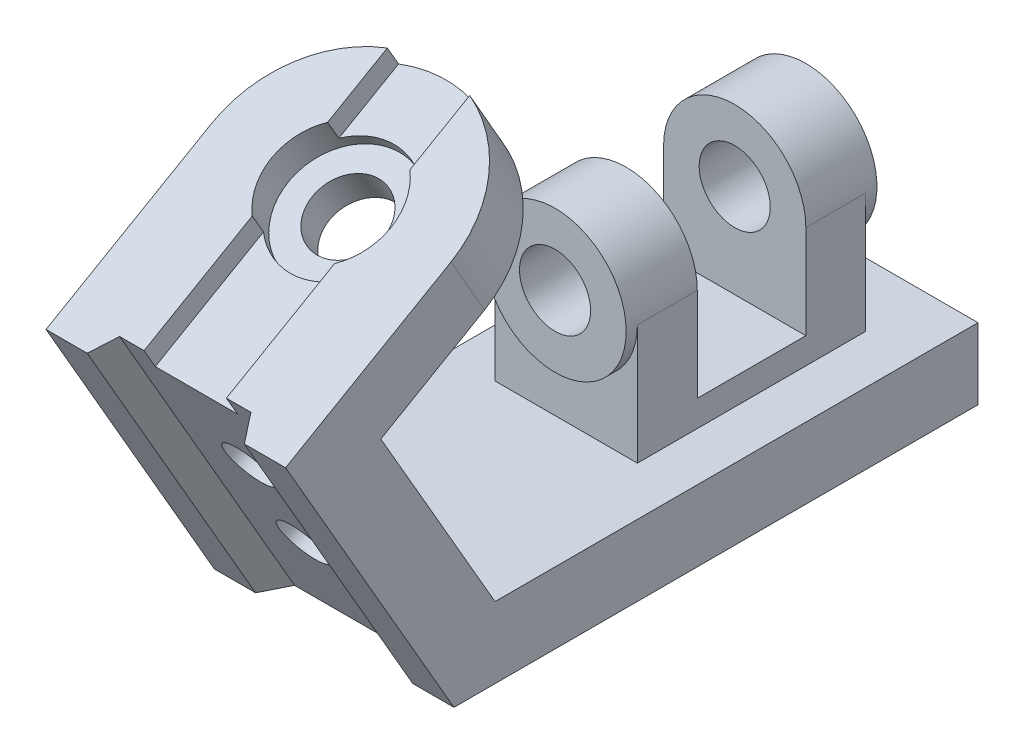
ISO-10303-21;
HEADER;
FILE_DESCRIPTION(('STEP AP214'),'2;1');
FILE_NAME('part.step','',(''),(''),'','','');
FILE_SCHEMA(('AUTOMOTIVE_DESIGN { 1 0 10303 214 1 1 1 1 }'));
ENDSEC;
DATA;
#1=APPLICATION_CONTEXT('core data for automotive mechanical design processes');
#2=APPLICATION_PROTOCOL_DEFINITION('international standard','automotive_design',2000,#1);
#3=PRODUCT_CONTEXT('',#1,'mechanical');
#4=PRODUCT('Part','Part','',(#3));
#5=PRODUCT_RELATED_PRODUCT_CATEGORY('part','',(#4));
#6=PRODUCT_DEFINITION_FORMATION('','',#4);
#7=PRODUCT_DEFINITION_CONTEXT('part definition',#1,'design');
#8=PRODUCT_DEFINITION('design','',#6,#7);
#9=PRODUCT_DEFINITION_SHAPE('','',#8);
#10=(LENGTH_UNIT() NAMED_UNIT(*) SI_UNIT(.MILLI.,.METRE.));
#11=(NAMED_UNIT(*) PLANE_ANGLE_UNIT() SI_UNIT($,.RADIAN.));
#12=(NAMED_UNIT(*) SI_UNIT($,.STERADIAN.) SOLID_ANGLE_UNIT());
#13=UNCERTAINTY_MEASURE_WITH_UNIT(LENGTH_MEASURE(1.E-05),#10,'distance_accuracy_value','');
#14=(GEOMETRIC_REPRESENTATION_CONTEXT(3) GLOBAL_UNCERTAINTY_ASSIGNED_CONTEXT((#13)) GLOBAL_UNIT_ASSIGNED_CONTEXT((#10,
#11,#12)) REPRESENTATION_CONTEXT('',''));
#15=CARTESIAN_POINT('',(0.,0.,0.));
#16=DIRECTION('',(0.,0.,1.));
#17=DIRECTION('',(1.,0.,0.));
#18=AXIS2_PLACEMENT_3D('',#15,#16,#17);
#19=CARTESIAN_POINT('',(19.,70.,-62.));
#20=DIRECTION('',(0.,0.,-1.));
#21=DIRECTION('',(-1.,0.,0.));
#22=AXIS2_PLACEMENT_3D('',#19,#20,#21);
#23=PLANE('',#22);
#24=CARTESIAN_POINT('',(0.,51.,-62.));
#25=DIRECTION('',(0.,0.,1.));
#26=DIRECTION('',(1.,0.,0.));
#27=AXIS2_PLACEMENT_3D('',#24,#25,#26);
#28=CIRCLE('',#27,19.);
#29=CARTESIAN_POINT('',(-19.,51.,-62.));
#30=VERTEX_POINT('',#29);
#31=CARTESIAN_POINT('',(19.,51.,-62.));
#32=VERTEX_POINT('',#31);
#33=EDGE_CURVE('E238',#30,#32,#28,.T.);
#34=ORIENTED_EDGE('',*,*,#33,.F.);
#35=DIRECTION('',(0.,-1.,0.));
#36=VECTOR('',#35,1.);
#37=CARTESIAN_POINT('',(-19.,70.,-62.));
#38=LINE('',#37,#36);
#39=CARTESIAN_POINT('',(-19.,19.,-62.));
#40=VERTEX_POINT('',#39);
#41=EDGE_CURVE('E221',#30,#40,#38,.T.);
#42=ORIENTED_EDGE('',*,*,#41,.T.);
#43=DIRECTION('',(-1.,0.,0.));
#44=VECTOR('',#43,1.);
#45=CARTESIAN_POINT('',(19.,19.,-62.));
#46=LINE('',#45,#44);
#47=CARTESIAN_POINT('',(19.,19.,-62.));
#48=VERTEX_POINT('',#47);
#49=EDGE_CURVE('E290',#48,#40,#46,.T.);
#50=ORIENTED_EDGE('',*,*,#49,.F.);
#51=DIRECTION('',(0.,-1.,0.));
#52=VECTOR('',#51,1.);
#53=CARTESIAN_POINT('',(19.,70.,-62.));
#54=LINE('',#53,#52);
#55=EDGE_CURVE('E244',#32,#48,#54,.T.);
#56=ORIENTED_EDGE('',*,*,#55,.F.);
#57=EDGE_LOOP('',(#34,#42,#50,#56));
#58=FACE_BOUND('',#57,.T.);
#59=ADVANCED_FACE('F36',(#58),#23,.F.);
#60=CARTESIAN_POINT('',(19.,19.,-123.));
#61=DIRECTION('',(0.,0.,1.));
#62=DIRECTION('',(1.,0.,0.));
#63=AXIS2_PLACEMENT_3D('',#60,#61,#62);
#64=PLANE('',#63);
#65=CARTESIAN_POINT('',(0.,51.,-123.));
#66=DIRECTION('',(0.,0.,-1.));
#67=DIRECTION('',(-1.,0.,0.));
#68=AXIS2_PLACEMENT_3D('',#65,#66,#67);
#69=CIRCLE('',#68,19.);
#70=CARTESIAN_POINT('',(19.,51.,-123.));
#71=VERTEX_POINT('',#70);
#72=CARTESIAN_POINT('',(-19.,51.,-123.));
#73=VERTEX_POINT('',#72);
#74=EDGE_CURVE('E249',#71,#73,#69,.T.);
#75=ORIENTED_EDGE('',*,*,#74,.F.);
#76=DIRECTION('',(0.,1.,0.));
#77=VECTOR('',#76,1.);
#78=CARTESIAN_POINT('',(19.,19.,-123.));
#79=LINE('',#78,#77);
#80=CARTESIAN_POINT('',(19.,19.,-123.));
#81=VERTEX_POINT('',#80);
#82=EDGE_CURVE('E264',#81,#71,#79,.T.);
#83=ORIENTED_EDGE('',*,*,#82,.F.);
#84=DIRECTION('',(-1.,0.,0.));
#85=VECTOR('',#84,1.);
#86=CARTESIAN_POINT('',(19.,19.,-123.));
#87=LINE('',#86,#85);
#88=CARTESIAN_POINT('',(-19.,19.,-123.));
#89=VERTEX_POINT('',#88);
#90=EDGE_CURVE('E287',#81,#89,#87,.T.);
#91=ORIENTED_EDGE('',*,*,#90,.T.);
#92=DIRECTION('',(0.,1.,0.));
#93=VECTOR('',#92,1.);
#94=CARTESIAN_POINT('',(-19.,19.,-123.));
#95=LINE('',#94,#93);
#96=EDGE_CURVE('E275',#89,#73,#95,.T.);
#97=ORIENTED_EDGE('',*,*,#96,.T.);
#98=EDGE_LOOP('',(#75,#83,#91,#97));
#99=FACE_BOUND('',#98,.T.);
#100=ADVANCED_FACE('F482',(#99),#64,.F.);
#101=CARTESIAN_POINT('',(0.,51.,-107.));
#102=DIRECTION('',(0.,0.,1.));
#103=DIRECTION('',(1.,0.,0.));
#104=AXIS2_PLACEMENT_3D('',#101,#102,#103);
#105=CYLINDRICAL_SURFACE('',#104,19.);
#106=DIRECTION('',(0.,0.,1.));
#107=VECTOR('',#106,1.);
#108=CARTESIAN_POINT('',(-19.,51.,0.));
#109=LINE('',#108,#107);
#110=CARTESIAN_POINT('',(-19.,51.,-107.));
#111=VERTEX_POINT('',#110);
#112=EDGE_CURVE('E57',#111,#73,#109,.F.);
#113=ORIENTED_EDGE('',*,*,#112,.F.);
#114=CARTESIAN_POINT('',(0.,51.,-107.));
#115=DIRECTION('',(0.,0.,-1.));
#116=DIRECTION('',(-1.,0.,0.));
#117=AXIS2_PLACEMENT_3D('',#114,#115,#116);
#118=CIRCLE('',#117,19.);
#119=CARTESIAN_POINT('',(19.,51.,-107.));
#120=VERTEX_POINT('',#119);
#121=EDGE_CURVE('E11',#120,#111,#118,.F.);
#122=ORIENTED_EDGE('',*,*,#121,.F.);
#123=DIRECTION('',(0.,0.,-1.));
#124=VECTOR('',#123,1.);
#125=CARTESIAN_POINT('',(19.,51.,-107.));
#126=LINE('',#125,#124);
#127=EDGE_CURVE('E45',#71,#120,#126,.F.);
#128=ORIENTED_EDGE('',*,*,#127,.F.);
#129=ORIENTED_EDGE('',*,*,#74,.T.);
#130=EDGE_LOOP('',(#113,#122,#128,#129));
#131=FACE_BOUND('',#130,.T.);
#132=CARTESIAN_POINT('',(0.,51.,-126.));
#133=DIRECTION('',(0.,0.,-1.));
#134=DIRECTION('',(-1.,0.,0.));
#135=AXIS2_PLACEMENT_3D('',#132,#133,#134);
#136=CIRCLE('',#135,19.);
#137=CARTESIAN_POINT('',(-19.,51.,-126.));
#138=VERTEX_POINT('',#137);
#139=EDGE_CURVE('E232',#138,#138,#136,.T.);
#140=ORIENTED_EDGE('',*,*,#139,.F.);
#141=EDGE_LOOP('',(#140));
#142=FACE_BOUND('',#141,.T.);
#143=ADVANCED_FACE('F39',(#131,#142),#105,.T.);
#144=CARTESIAN_POINT('',(0.,51.,-62.));
#145=DIRECTION('',(0.,0.,1.));
#146=DIRECTION('',(1.,0.,0.));
#147=AXIS2_PLACEMENT_3D('',#144,#145,#146);
#148=CYLINDRICAL_SURFACE('',#147,19.);
#149=DIRECTION('',(0.,0.,1.));
#150=VECTOR('',#149,1.);
#151=CARTESIAN_POINT('',(-19.,51.,0.));
#152=LINE('',#151,#150);
#153=CARTESIAN_POINT('',(-19.,51.,-78.));
#154=VERTEX_POINT('',#153);
#155=EDGE_CURVE('E225',#30,#154,#152,.F.);
#156=ORIENTED_EDGE('',*,*,#155,.F.);
#157=ORIENTED_EDGE('',*,*,#33,.T.);
#158=DIRECTION('',(0.,0.,-1.));
#159=VECTOR('',#158,1.);
#160=CARTESIAN_POINT('',(19.,51.,-62.));
#161=LINE('',#160,#159);
#162=CARTESIAN_POINT('',(19.,51.,-78.));
#163=VERTEX_POINT('',#162);
#164=EDGE_CURVE('E452',#163,#32,#161,.F.);
#165=ORIENTED_EDGE('',*,*,#164,.F.);
#166=CARTESIAN_POINT('',(0.,51.,-78.));
#167=DIRECTION('',(0.,0.,1.));
#168=DIRECTION('',(1.,0.,0.));
#169=AXIS2_PLACEMENT_3D('',#166,#167,#168);
#170=CIRCLE('',#169,19.);
#171=EDGE_CURVE('E240',#154,#163,#170,.F.);
#172=ORIENTED_EDGE('',*,*,#171,.F.);
#173=EDGE_LOOP('',(#156,#157,#165,#172));
#174=FACE_BOUND('',#173,.T.);
#175=CARTESIAN_POINT('',(0.,51.,-59.));
#176=DIRECTION('',(0.,0.,1.));
#177=DIRECTION('',(1.,0.,0.));
#178=AXIS2_PLACEMENT_3D('',#175,#176,#177);
#179=CIRCLE('',#178,19.);
#180=CARTESIAN_POINT('',(19.,51.,-59.));
#181=VERTEX_POINT('',#180);
#182=EDGE_CURVE('E245',#181,#181,#179,.T.);
#183=ORIENTED_EDGE('',*,*,#182,.F.);
#184=EDGE_LOOP('',(#183));
#185=FACE_BOUND('',#184,.T.);
#186=ADVANCED_FACE('F236',(#174,#185),#148,.T.);
#187=CARTESIAN_POINT('',(32.,77.9422863405996,44.9999999999998));
#188=DIRECTION('',(0.,0.499999999999998,-0.86602540378444));
#189=DIRECTION('',(0.,0.86602540378444,0.499999999999998));
#190=AXIS2_PLACEMENT_3D('',#187,#188,#189);
#191=PLANE('',#190);
#192=DIRECTION('',(-1.,0.,0.));
#193=VECTOR('',#192,1.);
#194=CARTESIAN_POINT('',(32.,0.,0.));
#195=LINE('',#194,#193);
#196=CARTESIAN_POINT('',(-21.,0.,0.));
#197=VERTEX_POINT('',#196);
#198=CARTESIAN_POINT('',(-32.,0.,0.));
#199=VERTEX_POINT('',#198);
#200=EDGE_CURVE('E424',#197,#199,#195,.T.);
#201=ORIENTED_EDGE('',*,*,#200,.F.);
#202=DIRECTION('',(0.,0.86602540378444,0.499999999999998));
#203=VECTOR('',#202,1.);
#204=CARTESIAN_POINT('',(-21.,-60.6217782649106,-34.9999999999998));
#205=LINE('',#204,#203);
#206=CARTESIAN_POINT('',(-21.,77.9422863405996,44.9999999999998));
#207=VERTEX_POINT('',#206);
#208=EDGE_CURVE('E312',#197,#207,#205,.T.);
#209=ORIENTED_EDGE('',*,*,#208,.T.);
#210=DIRECTION('',(-1.,0.,0.));
#211=VECTOR('',#210,1.);
#212=CARTESIAN_POINT('',(32.,77.9422863405996,44.9999999999998));
#213=LINE('',#212,#211);
#214=CARTESIAN_POINT('',(-32.,77.9422863405996,44.9999999999998));
#215=VERTEX_POINT('',#214);
#216=EDGE_CURVE('E393',#207,#215,#213,.T.);
#217=ORIENTED_EDGE('',*,*,#216,.T.);
#218=DIRECTION('',(0.,-0.86602540378444,-0.499999999999998));
#219=VECTOR('',#218,1.);
#220=CARTESIAN_POINT('',(-32.,77.9422863405996,44.9999999999998));
#221=LINE('',#220,#219);
#222=EDGE_CURVE('E373',#215,#199,#221,.T.);
#223=ORIENTED_EDGE('',*,*,#222,.T.);
#224=EDGE_LOOP('',(#201,#209,#217,#223));
#225=FACE_BOUND('',#224,.T.);
#226=ADVANCED_FACE('F550',(#225),#191,.F.);
#227=CARTESIAN_POINT('',(32.,119.4422863406,-26.880108514109));
#228=DIRECTION('',(0.,-0.86602540378444,-0.499999999999998));
#229=DIRECTION('',(0.,0.499999999999998,-0.86602540378444));
#230=AXIS2_PLACEMENT_3D('',#227,#228,#229);
#231=PLANE('',#230);
#232=DIRECTION('',(0.,0.499999999999998,-0.86602540378444));
#233=VECTOR('',#232,1.);
#234=CARTESIAN_POINT('',(11.,77.9422863405996,44.9999999999998));
#235=LINE('',#234,#233);
#236=CARTESIAN_POINT('',(11.,80.9422863405996,39.8038475772932));
#237=VERTEX_POINT('',#236);
#238=CARTESIAN_POINT('',(11.,97.6328113212885,10.8950103057422));
#239=VERTEX_POINT('',#238);
#240=EDGE_CURVE('E365',#237,#239,#235,.T.);
#241=ORIENTED_EDGE('',*,*,#240,.F.);
#242=DIRECTION('',(-1.,0.,0.));
#243=VECTOR('',#242,1.);
#244=CARTESIAN_POINT('',(17.5358983848623,80.9422863405996,39.8038475772932));
#245=LINE('',#244,#243);
#246=CARTESIAN_POINT('',(17.5358983848623,80.9422863405996,39.8038475772932));
#247=VERTEX_POINT('',#246);
#248=EDGE_CURVE('E310',#247,#237,#245,.T.);
#249=ORIENTED_EDGE('',*,*,#248,.F.);
#250=DIRECTION('',(-0.499999999999995,0.433012701892219,-0.750000000000004));
#251=VECTOR('',#250,1.);
#252=CARTESIAN_POINT('',(21.,77.9422863405996,44.9999999999998));
#253=LINE('',#252,#251);
#254=CARTESIAN_POINT('',(21.,77.9422863405996,44.9999999999998));
#255=VERTEX_POINT('',#254);
#256=EDGE_CURVE('E306',#255,#247,#253,.T.);
#257=ORIENTED_EDGE('',*,*,#256,.F.);
#258=CARTESIAN_POINT('',(32.,77.9422863405996,44.9999999999998));
#259=VERTEX_POINT('',#258);
#260=EDGE_CURVE('E409',#259,#255,#213,.T.);
#261=ORIENTED_EDGE('',*,*,#260,.F.);
#262=DIRECTION('',(0.,-0.499999999999998,0.86602540378444));
#263=VECTOR('',#262,1.);
#264=CARTESIAN_POINT('',(32.,119.4422863406,-26.880108514109));
#265=LINE('',#264,#263);
#266=CARTESIAN_POINT('',(32.,103.4422863406,0.832704406993078));
#267=VERTEX_POINT('',#266);
#268=EDGE_CURVE('E391',#267,#259,#265,.T.);
#269=ORIENTED_EDGE('',*,*,#268,.F.);
#270=CARTESIAN_POINT('',(0.,103.4422863406,0.832704406993078));
#271=DIRECTION('',(0.,-0.86602540378444,-0.499999999999998));
#272=DIRECTION('',(0.,0.499999999999998,-0.86602540378444));
#273=AXIS2_PLACEMENT_3D('',#270,#271,#272);
#274=CIRCLE('',#273,32.);
#275=CARTESIAN_POINT('',(11.,118.467265541916,-25.1913229523532));
#276=VERTEX_POINT('',#275);
#277=EDGE_CURVE('E435',#267,#276,#274,.F.);
#278=ORIENTED_EDGE('',*,*,#277,.T.);
#279=CARTESIAN_POINT('',(11.,109.251761359911,-9.229601491756));
#280=VERTEX_POINT('',#279);
#281=EDGE_CURVE('E354',#280,#276,#235,.T.);
#282=ORIENTED_EDGE('',*,*,#281,.F.);
#283=CARTESIAN_POINT('',(0.,103.4422863406,0.832704406993082));
#284=DIRECTION('',(0.,0.86602540378444,0.499999999999998));
#285=DIRECTION('',(0.,-0.499999999999998,0.86602540378444));
#286=AXIS2_PLACEMENT_3D('',#283,#284,#285);
#287=CIRCLE('',#286,16.);
#288=EDGE_CURVE('E331',#239,#280,#287,.T.);
#289=ORIENTED_EDGE('',*,*,#288,.F.);
#290=EDGE_LOOP('',(#241,#249,#257,#261,#269,#278,#282,#289));
#291=FACE_BOUND('',#290,.T.);
#292=ADVANCED_FACE('F547',(#291),#231,.F.);
#293=CARTESIAN_POINT('',(-11.,72.7461339178929,41.9999999999999));
#294=DIRECTION('',(-1.,0.,0.));
#295=DIRECTION('',(0.,0.,1.));
#296=AXIS2_PLACEMENT_3D('',#293,#294,#295);
#297=PLANE('',#296);
#298=DIRECTION('',(0.,-0.499999999999998,0.86602540378444));
#299=VECTOR('',#298,1.);
#300=CARTESIAN_POINT('',(-11.,77.9422863405996,44.9999999999998));
#301=LINE('',#300,#299);
#302=CARTESIAN_POINT('',(-11.,97.6328113212885,10.8950103057422));
#303=VERTEX_POINT('',#302);
#304=CARTESIAN_POINT('',(-11.,80.9422863405996,39.8038475772932));
#305=VERTEX_POINT('',#304);
#306=EDGE_CURVE('E367',#303,#305,#301,.T.);
#307=ORIENTED_EDGE('',*,*,#306,.T.);
#308=DIRECTION('',(0.,-0.86602540378444,-0.499999999999998));
#309=VECTOR('',#308,1.);
#310=CARTESIAN_POINT('',(-11.,75.7461339178929,36.8038475772932));
#311=LINE('',#310,#309);
#312=CARTESIAN_POINT('',(-11.,75.7461339178929,36.8038475772932));
#313=VERTEX_POINT('',#312);
#314=EDGE_CURVE('E324',#305,#313,#311,.T.);
#315=ORIENTED_EDGE('',*,*,#314,.T.);
#316=DIRECTION('',(0.,-0.499999999999998,0.86602540378444));
#317=VECTOR('',#316,1.);
#318=CARTESIAN_POINT('',(-11.,72.7461339178929,41.9999999999999));
#319=LINE('',#318,#317);
#320=CARTESIAN_POINT('',(-11.,92.4366588985819,7.89501030574217));
#321=VERTEX_POINT('',#320);
#322=EDGE_CURVE('E360',#321,#313,#319,.T.);
#323=ORIENTED_EDGE('',*,*,#322,.F.);
#324=DIRECTION('',(0.,0.86602540378444,0.499999999999998));
#325=VECTOR('',#324,1.);
#326=CARTESIAN_POINT('',(-11.,97.6328113212885,10.8950103057422));
#327=LINE('',#326,#325);
#328=EDGE_CURVE('E345',#321,#303,#327,.T.);
#329=ORIENTED_EDGE('',*,*,#328,.T.);
#330=EDGE_LOOP('',(#307,#315,#323,#329));
#331=FACE_BOUND('',#330,.T.);
#332=ADVANCED_FACE('F534',(#331),#297,.F.);
#333=CARTESIAN_POINT('',(11.,72.7461339178929,41.9999999999998));
#334=DIRECTION('',(1.,0.,0.));
#335=DIRECTION('',(0.,0.,-1.));
#336=AXIS2_PLACEMENT_3D('',#333,#334,#335);
#337=PLANE('',#336);
#338=DIRECTION('',(0.,0.499999999999998,-0.86602540378444));
#339=VECTOR('',#338,1.);
#340=CARTESIAN_POINT('',(11.,72.7461339178929,41.9999999999998));
#341=LINE('',#340,#339);
#342=CARTESIAN_POINT('',(11.,104.055608937204,-12.229601491756));
#343=VERTEX_POINT('',#342);
#344=CARTESIAN_POINT('',(11.,113.27111311921,-28.1913229523531));
#345=VERTEX_POINT('',#344);
#346=EDGE_CURVE('E358',#343,#345,#341,.T.);
#347=ORIENTED_EDGE('',*,*,#346,.F.);
#348=DIRECTION('',(0.,0.86602540378444,0.499999999999998));
#349=VECTOR('',#348,1.);
#350=CARTESIAN_POINT('',(11.,109.251761359911,-9.229601491756));
#351=LINE('',#350,#349);
#352=EDGE_CURVE('E351',#343,#280,#351,.T.);
#353=ORIENTED_EDGE('',*,*,#352,.T.);
#354=ORIENTED_EDGE('',*,*,#281,.T.);
#355=DIRECTION('',(0.,0.86602540378444,0.499999999999998));
#356=VECTOR('',#355,1.);
#357=CARTESIAN_POINT('',(11.,113.27111311921,-28.1913229523531));
#358=LINE('',#357,#356);
#359=EDGE_CURVE('E364',#345,#276,#358,.T.);
#360=ORIENTED_EDGE('',*,*,#359,.F.);
#361=EDGE_LOOP('',(#347,#353,#354,#360));
#362=FACE_BOUND('',#361,.T.);
#363=ADVANCED_FACE('F538',(#362),#337,.F.);
#364=CARTESIAN_POINT('',(0.,98.246133917893,-2.16729559300691));
#365=DIRECTION('',(0.,0.86602540378444,0.499999999999998));
#366=DIRECTION('',(0.,-0.499999999999998,0.86602540378444));
#367=AXIS2_PLACEMENT_3D('',#364,#365,#366);
#368=PLANE('',#367);
#369=CARTESIAN_POINT('',(0.,98.246133917893,-2.16729559300691));
#370=DIRECTION('',(0.,0.86602540378444,0.499999999999998));
#371=DIRECTION('',(0.,-0.499999999999998,0.86602540378444));
#372=AXIS2_PLACEMENT_3D('',#369,#370,#371);
#373=CIRCLE('',#372,16.);
#374=CARTESIAN_POINT('',(-11.,104.055608937204,-12.229601491756));
#375=VERTEX_POINT('',#374);
#376=EDGE_CURVE('E443',#343,#375,#373,.T.);
#377=ORIENTED_EDGE('',*,*,#376,.F.);
#378=ORIENTED_EDGE('',*,*,#346,.T.);
#379=CARTESIAN_POINT('',(0.,98.246133917893,-2.16729559300691));
#380=DIRECTION('',(0.,0.86602540378444,0.499999999999998));
#381=DIRECTION('',(0.,-0.499999999999998,0.86602540378444));
#382=AXIS2_PLACEMENT_3D('',#379,#380,#381);
#383=CIRCLE('',#382,32.);
#384=CARTESIAN_POINT('',(-11.,113.27111311921,-28.1913229523531));
#385=VERTEX_POINT('',#384);
#386=EDGE_CURVE('E357',#345,#385,#383,.T.);
#387=ORIENTED_EDGE('',*,*,#386,.T.);
#388=EDGE_CURVE('E361',#385,#375,#319,.T.);
#389=ORIENTED_EDGE('',*,*,#388,.T.);
#390=EDGE_LOOP('',(#377,#378,#387,#389));
#391=FACE_BOUND('',#390,.T.);
#392=ADVANCED_FACE('F528',(#391),#368,.T.);
#393=ORIENTED_EDGE('',*,*,#216,.F.);
#394=DIRECTION('',(-0.500000000000003,-0.433012701892217,0.749999999999999));
#395=VECTOR('',#394,1.);
#396=CARTESIAN_POINT('',(-17.5358983848622,80.9422863405996,39.8038475772932));
#397=LINE('',#396,#395);
#398=CARTESIAN_POINT('',(-17.5358983848622,80.9422863405996,39.8038475772932));
#399=VERTEX_POINT('',#398);
#400=EDGE_CURVE('E304',#399,#207,#397,.T.);
#401=ORIENTED_EDGE('',*,*,#400,.F.);
#402=EDGE_CURVE('E309',#305,#399,#245,.T.);
#403=ORIENTED_EDGE('',*,*,#402,.F.);
#404=ORIENTED_EDGE('',*,*,#306,.F.);
#405=CARTESIAN_POINT('',(-11.,109.251761359911,-9.229601491756));
#406=VERTEX_POINT('',#405);
#407=EDGE_CURVE('E330',#406,#303,#287,.T.);
#408=ORIENTED_EDGE('',*,*,#407,.F.);
#409=CARTESIAN_POINT('',(-11.,118.467265541916,-25.1913229523532));
#410=VERTEX_POINT('',#409);
#411=EDGE_CURVE('E368',#410,#406,#301,.T.);
#412=ORIENTED_EDGE('',*,*,#411,.F.);
#413=CARTESIAN_POINT('',(-32.,103.4422863406,0.832704406993078));
#414=VERTEX_POINT('',#413);
#415=EDGE_CURVE('E434',#410,#414,#274,.F.);
#416=ORIENTED_EDGE('',*,*,#415,.T.);
#417=DIRECTION('',(0.,-0.499999999999998,0.86602540378444));
#418=VECTOR('',#417,1.);
#419=CARTESIAN_POINT('',(-32.,119.4422863406,-26.880108514109));
#420=LINE('',#419,#418);
#421=EDGE_CURVE('E380',#414,#215,#420,.T.);
#422=ORIENTED_EDGE('',*,*,#421,.T.);
#423=EDGE_LOOP('',(#393,#401,#403,#404,#408,#412,#416,#422));
#424=FACE_BOUND('',#423,.T.);
#425=ADVANCED_FACE('F552',(#424),#231,.F.);
#426=CARTESIAN_POINT('',(0.,103.4422863406,0.832704406993078));
#427=DIRECTION('',(0.,0.866025403784444,0.49999999999999));
#428=DIRECTION('',(0.,-0.49999999999999,0.866025403784444));
#429=AXIS2_PLACEMENT_3D('',#426,#427,#428);
#430=CYLINDRICAL_SURFACE('',#429,32.);
#431=DIRECTION('',(0.,0.86602540378444,0.499999999999998));
#432=VECTOR('',#431,1.);
#433=CARTESIAN_POINT('',(-11.,113.27111311921,-28.1913229523531));
#434=LINE('',#433,#432);
#435=EDGE_CURVE('E371',#385,#410,#434,.T.);
#436=ORIENTED_EDGE('',*,*,#435,.F.);
#437=ORIENTED_EDGE('',*,*,#386,.F.);
#438=ORIENTED_EDGE('',*,*,#359,.T.);
#439=ORIENTED_EDGE('',*,*,#277,.F.);
#440=DIRECTION('',(0.,-0.866025403784444,-0.49999999999999));
#441=VECTOR('',#440,1.);
#442=CARTESIAN_POINT('',(32.,103.4422863406,0.832704406993078));
#443=LINE('',#442,#441);
#444=CARTESIAN_POINT('',(32.,87.85382907248,-8.16729559300656));
#445=VERTEX_POINT('',#444);
#446=EDGE_CURVE('E431',#445,#267,#443,.F.);
#447=ORIENTED_EDGE('',*,*,#446,.F.);
#448=CARTESIAN_POINT('',(0.,87.85382907248,-8.16729559300656));
#449=DIRECTION('',(0.,0.866025403784445,0.499999999999989));
#450=DIRECTION('',(0.,-0.499999999999989,0.866025403784445));
#451=AXIS2_PLACEMENT_3D('',#448,#449,#450);
#452=CIRCLE('',#451,32.);
#453=CARTESIAN_POINT('',(-32.,87.85382907248,-8.16729559300656));
#454=VERTEX_POINT('',#453);
#455=EDGE_CURVE('E438',#454,#445,#452,.F.);
#456=ORIENTED_EDGE('',*,*,#455,.F.);
#457=DIRECTION('',(0.,0.866025403784444,0.49999999999999));
#458=VECTOR('',#457,1.);
#459=CARTESIAN_POINT('',(-32.,25.4999999999993,-44.1672955930063));
#460=LINE('',#459,#458);
#461=EDGE_CURVE('E428',#414,#454,#460,.F.);
#462=ORIENTED_EDGE('',*,*,#461,.F.);
#463=ORIENTED_EDGE('',*,*,#415,.F.);
#464=EDGE_LOOP('',(#436,#437,#438,#439,#447,#456,#462,#463));
#465=FACE_BOUND('',#464,.T.);
#466=ADVANCED_FACE('F575',(#465),#430,.T.);
#467=ORIENTED_EDGE('',*,*,#260,.T.);
#468=DIRECTION('',(0.,0.86602540378444,0.499999999999998));
#469=VECTOR('',#468,1.);
#470=CARTESIAN_POINT('',(21.,-60.6217782649106,-34.9999999999998));
#471=LINE('',#470,#469);
#472=CARTESIAN_POINT('',(21.,0.,0.));
#473=VERTEX_POINT('',#472);
#474=EDGE_CURVE('E318',#473,#255,#471,.T.);
#475=ORIENTED_EDGE('',*,*,#474,.F.);
#476=CARTESIAN_POINT('',(32.,0.,0.));
#477=VERTEX_POINT('',#476);
#478=EDGE_CURVE('E425',#477,#473,#195,.T.);
#479=ORIENTED_EDGE('',*,*,#478,.F.);
#480=DIRECTION('',(0.,-0.86602540378444,-0.499999999999998));
#481=VECTOR('',#480,1.);
#482=CARTESIAN_POINT('',(32.,77.9422863405996,44.9999999999998));
#483=LINE('',#482,#481);
#484=EDGE_CURVE('E376',#259,#477,#483,.T.);
#485=ORIENTED_EDGE('',*,*,#484,.F.);
#486=EDGE_LOOP('',(#467,#475,#479,#485));
#487=FACE_BOUND('',#486,.T.);
#488=ADVANCED_FACE('F571',(#487),#191,.F.);
#489=CARTESIAN_POINT('',(32.,0.,0.));
#490=DIRECTION('',(0.,1.,0.));
#491=DIRECTION('',(0.,0.,1.));
#492=AXIS2_PLACEMENT_3D('',#489,#490,#491);
#493=PLANE('',#492);
#494=DIRECTION('',(-1.,0.,0.));
#495=VECTOR('',#494,1.);
#496=CARTESIAN_POINT('',(32.,0.,-6.92820323027554));
#497=LINE('',#496,#495);
#498=CARTESIAN_POINT('',(17.5358983848623,0.,-6.92820323027554));
#499=VERTEX_POINT('',#498);
#500=CARTESIAN_POINT('',(-17.5358983848622,0.,-6.92820323027554));
#501=VERTEX_POINT('',#500);
#502=EDGE_CURVE('E327',#499,#501,#497,.T.);
#503=ORIENTED_EDGE('',*,*,#502,.T.);
#504=DIRECTION('',(-0.447213595499961,0.,0.894427190999914));
#505=VECTOR('',#504,1.);
#506=CARTESIAN_POINT('',(-10.3999999999999,0.,-21.2000000000001));
#507=LINE('',#506,#505);
#508=EDGE_CURVE('E241',#501,#197,#507,.T.);
#509=ORIENTED_EDGE('',*,*,#508,.T.);
#510=ORIENTED_EDGE('',*,*,#200,.T.);
#511=DIRECTION('',(0.,0.,-1.));
#512=VECTOR('',#511,1.);
#513=CARTESIAN_POINT('',(-32.,0.,0.));
#514=LINE('',#513,#512);
#515=CARTESIAN_POINT('',(-32.,0.,-140.));
#516=VERTEX_POINT('',#515);
#517=EDGE_CURVE('E396',#199,#516,#514,.T.);
#518=ORIENTED_EDGE('',*,*,#517,.T.);
#519=DIRECTION('',(-1.,0.,0.));
#520=VECTOR('',#519,1.);
#521=CARTESIAN_POINT('',(32.,0.,-140.));
#522=LINE('',#521,#520);
#523=CARTESIAN_POINT('',(32.,0.,-140.));
#524=VERTEX_POINT('',#523);
#525=EDGE_CURVE('E421',#524,#516,#522,.T.);
#526=ORIENTED_EDGE('',*,*,#525,.F.);
#527=DIRECTION('',(0.,0.,-1.));
#528=VECTOR('',#527,1.);
#529=CARTESIAN_POINT('',(32.,0.,0.));
#530=LINE('',#529,#528);
#531=EDGE_CURVE('E379',#477,#524,#530,.T.);
#532=ORIENTED_EDGE('',*,*,#531,.F.);
#533=ORIENTED_EDGE('',*,*,#478,.T.);
#534=DIRECTION('',(-0.447213595499954,0.,-0.894427190999918));
#535=VECTOR('',#534,1.);
#536=CARTESIAN_POINT('',(23.2,0.,4.39999999999996));
#537=LINE('',#536,#535);
#538=EDGE_CURVE('E446',#473,#499,#537,.T.);
#539=ORIENTED_EDGE('',*,*,#538,.T.);
#540=EDGE_LOOP('',(#503,#509,#510,#518,#526,#532,#533,#539));
#541=FACE_BOUND('',#540,.T.);
#542=ADVANCED_FACE('F567',(#541),#493,.F.);
#543=CARTESIAN_POINT('',(32.,0.,-140.));
#544=DIRECTION('',(0.,0.,1.));
#545=DIRECTION('',(1.,0.,0.));
#546=AXIS2_PLACEMENT_3D('',#543,#544,#545);
#547=PLANE('',#546);
#548=DIRECTION('',(0.,1.,0.));
#549=VECTOR('',#548,1.);
#550=CARTESIAN_POINT('',(-32.,0.,-140.));
#551=LINE('',#550,#549);
#552=CARTESIAN_POINT('',(-32.,19.,-140.));
#553=VERTEX_POINT('',#552);
#554=EDGE_CURVE('E398',#516,#553,#551,.T.);
#555=ORIENTED_EDGE('',*,*,#554,.T.);
#556=DIRECTION('',(-1.,0.,0.));
#557=VECTOR('',#556,1.);
#558=CARTESIAN_POINT('',(32.,19.,-140.));
#559=LINE('',#558,#557);
#560=CARTESIAN_POINT('',(32.,19.,-140.));
#561=VERTEX_POINT('',#560);
#562=EDGE_CURVE('E418',#561,#553,#559,.T.);
#563=ORIENTED_EDGE('',*,*,#562,.F.);
#564=DIRECTION('',(0.,1.,0.));
#565=VECTOR('',#564,1.);
#566=CARTESIAN_POINT('',(32.,0.,-140.));
#567=LINE('',#566,#565);
#568=EDGE_CURVE('E382',#524,#561,#567,.T.);
#569=ORIENTED_EDGE('',*,*,#568,.F.);
#570=ORIENTED_EDGE('',*,*,#525,.T.);
#571=EDGE_LOOP('',(#555,#563,#569,#570));
#572=FACE_BOUND('',#571,.T.);
#573=ADVANCED_FACE('F563',(#572),#547,.F.);
#574=CARTESIAN_POINT('',(32.,19.,-140.));
#575=DIRECTION('',(0.,-1.,0.));
#576=DIRECTION('',(0.,0.,-1.));
#577=AXIS2_PLACEMENT_3D('',#574,#575,#576);
#578=PLANE('',#577);
#579=ORIENTED_EDGE('',*,*,#90,.F.);
#580=DIRECTION('',(0.,0.,-1.));
#581=VECTOR('',#580,1.);
#582=CARTESIAN_POINT('',(19.,19.,-62.));
#583=LINE('',#582,#581);
#584=EDGE_CURVE('E260',#48,#81,#583,.T.);
#585=ORIENTED_EDGE('',*,*,#584,.F.);
#586=ORIENTED_EDGE('',*,*,#49,.T.);
#587=DIRECTION('',(0.,0.,-1.));
#588=VECTOR('',#587,1.);
#589=CARTESIAN_POINT('',(-19.,19.,-62.));
#590=LINE('',#589,#588);
#591=EDGE_CURVE('E227',#40,#89,#590,.T.);
#592=ORIENTED_EDGE('',*,*,#591,.T.);
#593=EDGE_LOOP('',(#579,#585,#586,#592));
#594=FACE_BOUND('',#593,.T.);
#595=DIRECTION('',(0.,0.,1.));
#596=VECTOR('',#595,1.);
#597=CARTESIAN_POINT('',(-32.,19.,-140.));
#598=LINE('',#597,#596);
#599=CARTESIAN_POINT('',(-32.,19.,-10.9696551146032));
#600=VERTEX_POINT('',#599);
#601=EDGE_CURVE('E400',#553,#600,#598,.T.);
#602=ORIENTED_EDGE('',*,*,#601,.T.);
#603=DIRECTION('',(-1.,0.,0.));
#604=VECTOR('',#603,1.);
#605=CARTESIAN_POINT('',(32.,19.,-10.9696551146032));
#606=LINE('',#605,#604);
#607=CARTESIAN_POINT('',(32.,19.,-10.9696551146032));
#608=VERTEX_POINT('',#607);
#609=EDGE_CURVE('E415',#608,#600,#606,.T.);
#610=ORIENTED_EDGE('',*,*,#609,.F.);
#611=DIRECTION('',(0.,0.,1.));
#612=VECTOR('',#611,1.);
#613=CARTESIAN_POINT('',(32.,19.,-140.));
#614=LINE('',#613,#612);
#615=EDGE_CURVE('E384',#561,#608,#614,.T.);
#616=ORIENTED_EDGE('',*,*,#615,.F.);
#617=ORIENTED_EDGE('',*,*,#562,.T.);
#618=EDGE_LOOP('',(#602,#610,#616,#617));
#619=FACE_BOUND('',#618,.T.);
#620=ADVANCED_FACE('F559',(#594,#619),#578,.F.);
#621=CARTESIAN_POINT('',(32.,19.,-10.9696551146032));
#622=DIRECTION('',(0.,-0.499999999999999,0.866025403784439));
#623=DIRECTION('',(0.,-0.866025403784439,-0.499999999999999));
#624=AXIS2_PLACEMENT_3D('',#621,#622,#623);
#625=PLANE('',#624);
#626=CARTESIAN_POINT('',(0.,32.8826859021799,-2.95448267190464));
#627=DIRECTION('',(0.,-0.499999999999999,0.866025403784439));
#628=DIRECTION('',(0.,-0.866025403784439,-0.499999999999999));
#629=AXIS2_PLACEMENT_3D('',#626,#627,#628);
#630=CIRCLE('',#629,6.5);
#631=CARTESIAN_POINT('',(0.,27.2535207775811,-6.20448267190464));
#632=VERTEX_POINT('',#631);
#633=EDGE_CURVE('E295',#632,#632,#630,.F.);
#634=ORIENTED_EDGE('',*,*,#633,.F.);
#635=EDGE_LOOP('',(#634));
#636=FACE_BOUND('',#635,.T.);
#637=CARTESIAN_POINT('',(0.,57.9974226119287,11.5455173280953));
#638=DIRECTION('',(0.,-0.499999999999999,0.866025403784439));
#639=DIRECTION('',(0.,-0.866025403784439,-0.499999999999999));
#640=AXIS2_PLACEMENT_3D('',#637,#638,#639);
#641=CIRCLE('',#640,6.5);
#642=CARTESIAN_POINT('',(0.,52.3682574873298,8.29551732809534));
#643=VERTEX_POINT('',#642);
#644=EDGE_CURVE('E301',#643,#643,#641,.F.);
#645=ORIENTED_EDGE('',*,*,#644,.F.);
#646=EDGE_LOOP('',(#645));
#647=FACE_BOUND('',#646,.T.);
#648=DIRECTION('',(0.,0.866025403784439,0.499999999999999));
#649=VECTOR('',#648,1.);
#650=CARTESIAN_POINT('',(-32.,19.,-10.9696551146032));
#651=LINE('',#650,#649);
#652=CARTESIAN_POINT('',(-32.,71.8538290724803,19.5455173280957));
#653=VERTEX_POINT('',#652);
#654=EDGE_CURVE('E402',#600,#653,#651,.T.);
#655=ORIENTED_EDGE('',*,*,#654,.T.);
#656=DIRECTION('',(-1.,0.,0.));
#657=VECTOR('',#656,1.);
#658=CARTESIAN_POINT('',(32.,71.8538290724803,19.5455173280957));
#659=LINE('',#658,#657);
#660=CARTESIAN_POINT('',(32.,71.8538290724803,19.5455173280957));
#661=VERTEX_POINT('',#660);
#662=EDGE_CURVE('E412',#661,#653,#659,.T.);
#663=ORIENTED_EDGE('',*,*,#662,.F.);
#664=DIRECTION('',(0.,0.866025403784439,0.499999999999999));
#665=VECTOR('',#664,1.);
#666=CARTESIAN_POINT('',(32.,19.,-10.9696551146032));
#667=LINE('',#666,#665);
#668=EDGE_CURVE('E386',#608,#661,#667,.T.);
#669=ORIENTED_EDGE('',*,*,#668,.F.);
#670=ORIENTED_EDGE('',*,*,#609,.T.);
#671=EDGE_LOOP('',(#655,#663,#669,#670));
#672=FACE_BOUND('',#671,.T.);
#673=ADVANCED_FACE('F555',(#636,#647,#672),#625,.F.);
#674=CARTESIAN_POINT('',(32.,71.8538290724803,19.5455173280957));
#675=DIRECTION('',(0.,0.866025403784445,0.499999999999989));
#676=DIRECTION('',(0.,-0.499999999999989,0.866025403784445));
#677=AXIS2_PLACEMENT_3D('',#674,#675,#676);
#678=PLANE('',#677);
#679=CARTESIAN_POINT('',(0.,87.8538290724802,-8.16729559300662));
#680=DIRECTION('',(0.,0.86602540378444,0.499999999999998));
#681=DIRECTION('',(0.,-0.499999999999998,0.86602540378444));
#682=AXIS2_PLACEMENT_3D('',#679,#680,#681);
#683=CIRCLE('',#682,9.50000000000001);
#684=CARTESIAN_POINT('',(0.,83.1038290724802,0.0599457429455684));
#685=VERTEX_POINT('',#684);
#686=EDGE_CURVE('E339',#685,#685,#683,.T.);
#687=ORIENTED_EDGE('',*,*,#686,.T.);
#688=EDGE_LOOP('',(#687));
#689=FACE_BOUND('',#688,.T.);
#690=DIRECTION('',(0.,0.499999999999989,-0.866025403784445));
#691=VECTOR('',#690,1.);
#692=CARTESIAN_POINT('',(-32.,71.8538290724803,19.5455173280957));
#693=LINE('',#692,#691);
#694=EDGE_CURVE('E404',#653,#454,#693,.T.);
#695=ORIENTED_EDGE('',*,*,#694,.T.);
#696=ORIENTED_EDGE('',*,*,#455,.T.);
#697=DIRECTION('',(0.,0.499999999999989,-0.866025403784445));
#698=VECTOR('',#697,1.);
#699=CARTESIAN_POINT('',(32.,71.8538290724803,19.5455173280957));
#700=LINE('',#699,#698);
#701=EDGE_CURVE('E388',#661,#445,#700,.T.);
#702=ORIENTED_EDGE('',*,*,#701,.F.);
#703=ORIENTED_EDGE('',*,*,#662,.T.);
#704=EDGE_LOOP('',(#695,#696,#702,#703));
#705=FACE_BOUND('',#704,.T.);
#706=ADVANCED_FACE('F542',(#689,#705),#678,.F.);
#707=CARTESIAN_POINT('',(32.,0.,0.));
#708=DIRECTION('',(1.,0.,0.));
#709=DIRECTION('',(0.,0.,-1.));
#710=AXIS2_PLACEMENT_3D('',#707,#708,#709);
#711=PLANE('',#710);
#712=ORIENTED_EDGE('',*,*,#701,.T.);
#713=ORIENTED_EDGE('',*,*,#446,.T.);
#714=ORIENTED_EDGE('',*,*,#268,.T.);
#715=ORIENTED_EDGE('',*,*,#484,.T.);
#716=ORIENTED_EDGE('',*,*,#531,.T.);
#717=ORIENTED_EDGE('',*,*,#568,.T.);
#718=ORIENTED_EDGE('',*,*,#615,.T.);
#719=ORIENTED_EDGE('',*,*,#668,.T.);
#720=EDGE_LOOP('',(#712,#713,#714,#715,#716,#717,#718,#719));
#721=FACE_BOUND('',#720,.T.);
#722=ADVANCED_FACE('F539',(#721),#711,.T.);
#723=CARTESIAN_POINT('',(-32.,0.,0.));
#724=DIRECTION('',(1.,0.,0.));
#725=DIRECTION('',(0.,0.,-1.));
#726=AXIS2_PLACEMENT_3D('',#723,#724,#725);
#727=PLANE('',#726);
#728=ORIENTED_EDGE('',*,*,#421,.F.);
#729=ORIENTED_EDGE('',*,*,#461,.T.);
#730=ORIENTED_EDGE('',*,*,#694,.F.);
#731=ORIENTED_EDGE('',*,*,#654,.F.);
#732=ORIENTED_EDGE('',*,*,#601,.F.);
#733=ORIENTED_EDGE('',*,*,#554,.F.);
#734=ORIENTED_EDGE('',*,*,#517,.F.);
#735=ORIENTED_EDGE('',*,*,#222,.F.);
#736=EDGE_LOOP('',(#728,#729,#730,#731,#732,#733,#734,#735));
#737=FACE_BOUND('',#736,.T.);
#738=ADVANCED_FACE('F532',(#737),#727,.F.);
#739=ORIENTED_EDGE('',*,*,#411,.T.);
#740=DIRECTION('',(0.,0.86602540378444,0.499999999999998));
#741=VECTOR('',#740,1.);
#742=CARTESIAN_POINT('',(-11.,109.251761359911,-9.229601491756));
#743=LINE('',#742,#741);
#744=EDGE_CURVE('E348',#406,#375,#743,.F.);
#745=ORIENTED_EDGE('',*,*,#744,.T.);
#746=ORIENTED_EDGE('',*,*,#388,.F.);
#747=ORIENTED_EDGE('',*,*,#435,.T.);
#748=EDGE_LOOP('',(#739,#745,#746,#747));
#749=FACE_BOUND('',#748,.T.);
#750=ADVANCED_FACE('F529',(#749),#297,.F.);
#751=CARTESIAN_POINT('',(11.,75.7461339178929,36.8038475772932));
#752=VERTEX_POINT('',#751);
#753=CARTESIAN_POINT('',(11.,92.4366588985819,7.89501030574217));
#754=VERTEX_POINT('',#753);
#755=EDGE_CURVE('E355',#752,#754,#341,.T.);
#756=ORIENTED_EDGE('',*,*,#755,.F.);
#757=DIRECTION('',(0.,0.86602540378444,0.499999999999998));
#758=VECTOR('',#757,1.);
#759=CARTESIAN_POINT('',(11.,75.7461339178929,36.8038475772932));
#760=LINE('',#759,#758);
#761=EDGE_CURVE('E315',#752,#237,#760,.T.);
#762=ORIENTED_EDGE('',*,*,#761,.T.);
#763=ORIENTED_EDGE('',*,*,#240,.T.);
#764=DIRECTION('',(0.,0.86602540378444,0.499999999999998));
#765=VECTOR('',#764,1.);
#766=CARTESIAN_POINT('',(11.,97.6328113212885,10.8950103057422));
#767=LINE('',#766,#765);
#768=EDGE_CURVE('E342',#239,#754,#767,.F.);
#769=ORIENTED_EDGE('',*,*,#768,.T.);
#770=EDGE_LOOP('',(#756,#762,#763,#769));
#771=FACE_BOUND('',#770,.T.);
#772=ADVANCED_FACE('F526',(#771),#337,.F.);
#773=DIRECTION('',(-1.,0.,0.));
#774=VECTOR('',#773,1.);
#775=CARTESIAN_POINT('',(0.,75.7461339178929,36.8038475772932));
#776=LINE('',#775,#774);
#777=EDGE_CURVE('E444',#752,#313,#776,.T.);
#778=ORIENTED_EDGE('',*,*,#777,.F.);
#779=ORIENTED_EDGE('',*,*,#755,.T.);
#780=EDGE_CURVE('E440',#321,#754,#373,.T.);
#781=ORIENTED_EDGE('',*,*,#780,.F.);
#782=ORIENTED_EDGE('',*,*,#322,.T.);
#783=EDGE_LOOP('',(#778,#779,#781,#782));
#784=FACE_BOUND('',#783,.T.);
#785=ADVANCED_FACE('F516',(#784),#368,.T.);
#786=CARTESIAN_POINT('',(0.,103.4422863406,0.832704406993082));
#787=DIRECTION('',(0.,0.86602540378444,0.499999999999998));
#788=DIRECTION('',(0.,-0.499999999999998,0.86602540378444));
#789=AXIS2_PLACEMENT_3D('',#786,#787,#788);
#790=CYLINDRICAL_SURFACE('',#789,16.);
#791=CARTESIAN_POINT('',(0.,95.6480577065397,-3.6672955930069));
#792=DIRECTION('',(0.,0.86602540378444,0.499999999999998));
#793=DIRECTION('',(0.,-0.499999999999998,0.86602540378444));
#794=AXIS2_PLACEMENT_3D('',#791,#792,#793);
#795=CIRCLE('',#794,16.);
#796=CARTESIAN_POINT('',(0.,87.6480577065397,10.1891108675441));
#797=VERTEX_POINT('',#796);
#798=EDGE_CURVE('E333',#797,#797,#795,.T.);
#799=ORIENTED_EDGE('',*,*,#798,.F.);
#800=EDGE_LOOP('',(#799));
#801=FACE_BOUND('',#800,.T.);
#802=ORIENTED_EDGE('',*,*,#376,.T.);
#803=ORIENTED_EDGE('',*,*,#744,.F.);
#804=ORIENTED_EDGE('',*,*,#407,.T.);
#805=ORIENTED_EDGE('',*,*,#328,.F.);
#806=ORIENTED_EDGE('',*,*,#780,.T.);
#807=ORIENTED_EDGE('',*,*,#768,.F.);
#808=ORIENTED_EDGE('',*,*,#288,.T.);
#809=ORIENTED_EDGE('',*,*,#352,.F.);
#810=EDGE_LOOP('',(#802,#803,#804,#805,#806,#807,#808,#809));
#811=FACE_BOUND('',#810,.T.);
#812=ADVANCED_FACE('F512',(#801,#811),#790,.F.);
#813=CARTESIAN_POINT('',(0.,103.4422863406,0.832704406993082));
#814=DIRECTION('',(0.,0.86602540378444,0.499999999999998));
#815=DIRECTION('',(0.,-0.499999999999998,0.86602540378444));
#816=AXIS2_PLACEMENT_3D('',#813,#814,#815);
#817=CYLINDRICAL_SURFACE('',#816,9.50000000000001);
#818=ORIENTED_EDGE('',*,*,#686,.F.);
#819=EDGE_LOOP('',(#818));
#820=FACE_BOUND('',#819,.T.);
#821=CARTESIAN_POINT('',(0.,95.6480577065397,-3.6672955930069));
#822=DIRECTION('',(0.,0.86602540378444,0.499999999999998));
#823=DIRECTION('',(0.,-0.499999999999998,0.86602540378444));
#824=AXIS2_PLACEMENT_3D('',#821,#822,#823);
#825=CIRCLE('',#824,9.50000000000001);
#826=CARTESIAN_POINT('',(0.,90.8980577065397,4.55994574294528));
#827=VERTEX_POINT('',#826);
#828=EDGE_CURVE('E336',#827,#827,#825,.T.);
#829=ORIENTED_EDGE('',*,*,#828,.T.);
#830=EDGE_LOOP('',(#829));
#831=FACE_BOUND('',#830,.T.);
#832=ADVANCED_FACE('F515',(#820,#831),#817,.F.);
#833=CARTESIAN_POINT('',(9.50000000000001,95.6480577065397,-3.6672955930069));
#834=DIRECTION('',(0.,-0.86602540378444,-0.499999999999998));
#835=DIRECTION('',(0.,0.499999999999998,-0.86602540378444));
#836=AXIS2_PLACEMENT_3D('',#833,#834,#835);
#837=PLANE('',#836);
#838=ORIENTED_EDGE('',*,*,#828,.F.);
#839=EDGE_LOOP('',(#838));
#840=FACE_BOUND('',#839,.T.);
#841=ORIENTED_EDGE('',*,*,#798,.T.);
#842=EDGE_LOOP('',(#841));
#843=FACE_BOUND('',#842,.T.);
#844=ADVANCED_FACE('F510',(#840,#843),#837,.F.);
#845=CARTESIAN_POINT('',(-17.5358983848622,-57.6217782649106,-40.1961524227064));
#846=DIRECTION('',(-0.866025403784437,0.250000000000001,-0.433012701892223));
#847=DIRECTION('',(-0.447213595499961,0.,0.894427190999914));
#848=AXIS2_PLACEMENT_3D('',#845,#846,#847);
#849=PLANE('',#848);
#850=DIRECTION('',(0.,0.86602540378444,0.499999999999998));
#851=VECTOR('',#850,1.);
#852=CARTESIAN_POINT('',(-17.5358983848622,-57.6217782649106,-40.1961524227064));
#853=LINE('',#852,#851);
#854=EDGE_CURVE('E313',#501,#399,#853,.T.);
#855=ORIENTED_EDGE('',*,*,#854,.T.);
#856=ORIENTED_EDGE('',*,*,#400,.T.);
#857=ORIENTED_EDGE('',*,*,#208,.F.);
#858=ORIENTED_EDGE('',*,*,#508,.F.);
#859=EDGE_LOOP('',(#855,#856,#857,#858));
#860=FACE_BOUND('',#859,.T.);
#861=ADVANCED_FACE('F506',(#860),#849,.F.);
#862=CARTESIAN_POINT('',(21.,-60.6217782649106,-34.9999999999998));
#863=DIRECTION('',(0.866025403784441,0.249999999999997,-0.433012701892216));
#864=DIRECTION('',(-0.447213595499954,0.,-0.894427190999918));
#865=AXIS2_PLACEMENT_3D('',#862,#863,#864);
#866=PLANE('',#865);
#867=ORIENTED_EDGE('',*,*,#474,.T.);
#868=ORIENTED_EDGE('',*,*,#256,.T.);
#869=DIRECTION('',(0.,0.86602540378444,0.499999999999998));
#870=VECTOR('',#869,1.);
#871=CARTESIAN_POINT('',(17.5358983848623,-57.6217782649106,-40.1961524227064));
#872=LINE('',#871,#870);
#873=EDGE_CURVE('E316',#499,#247,#872,.T.);
#874=ORIENTED_EDGE('',*,*,#873,.F.);
#875=ORIENTED_EDGE('',*,*,#538,.F.);
#876=EDGE_LOOP('',(#867,#868,#874,#875));
#877=FACE_BOUND('',#876,.T.);
#878=ADVANCED_FACE('F502',(#877),#866,.F.);
#879=CARTESIAN_POINT('',(17.5358983848623,-57.6217782649106,-40.1961524227064));
#880=DIRECTION('',(0.,0.499999999999998,-0.86602540378444));
#881=DIRECTION('',(0.,0.86602540378444,0.499999999999998));
#882=AXIS2_PLACEMENT_3D('',#879,#880,#881);
#883=PLANE('',#882);
#884=CARTESIAN_POINT('',(0.,26.3826859021798,8.30384757729328));
#885=DIRECTION('',(0.,-0.499999999999998,0.86602540378444));
#886=DIRECTION('',(0.,-0.86602540378444,-0.499999999999998));
#887=AXIS2_PLACEMENT_3D('',#884,#885,#886);
#888=CIRCLE('',#887,6.5);
#889=CARTESIAN_POINT('',(0.,20.753520777581,5.05384757729329));
#890=VERTEX_POINT('',#889);
#891=EDGE_CURVE('E292',#890,#890,#888,.T.);
#892=ORIENTED_EDGE('',*,*,#891,.F.);
#893=EDGE_LOOP('',(#892));
#894=FACE_BOUND('',#893,.T.);
#895=CARTESIAN_POINT('',(0.,51.4974226119286,22.8038475772932));
#896=DIRECTION('',(0.,-0.499999999999998,0.86602540378444));
#897=DIRECTION('',(0.,-0.86602540378444,-0.499999999999998));
#898=AXIS2_PLACEMENT_3D('',#895,#896,#897);
#899=CIRCLE('',#898,6.5);
#900=CARTESIAN_POINT('',(0.,45.8682574873297,19.5538475772932));
#901=VERTEX_POINT('',#900);
#902=EDGE_CURVE('E298',#901,#901,#899,.T.);
#903=ORIENTED_EDGE('',*,*,#902,.F.);
#904=EDGE_LOOP('',(#903));
#905=FACE_BOUND('',#904,.T.);
#906=ORIENTED_EDGE('',*,*,#873,.T.);
#907=ORIENTED_EDGE('',*,*,#248,.T.);
#908=ORIENTED_EDGE('',*,*,#761,.F.);
#909=ORIENTED_EDGE('',*,*,#777,.T.);
#910=ORIENTED_EDGE('',*,*,#314,.F.);
#911=ORIENTED_EDGE('',*,*,#402,.T.);
#912=ORIENTED_EDGE('',*,*,#854,.F.);
#913=ORIENTED_EDGE('',*,*,#502,.F.);
#914=EDGE_LOOP('',(#906,#907,#908,#909,#910,#911,#912,#913));
#915=FACE_BOUND('',#914,.T.);
#916=ADVANCED_FACE('F498',(#894,#905,#915),#883,.F.);
#917=CARTESIAN_POINT('',(0.,67.1898107673538,-4.37616599999537));
#918=DIRECTION('',(0.,-0.499999999999998,0.86602540378444));
#919=DIRECTION('',(0.,-0.86602540378444,-0.499999999999998));
#920=AXIS2_PLACEMENT_3D('',#917,#918,#919);
#921=CYLINDRICAL_SURFACE('',#920,6.5);
#922=ORIENTED_EDGE('',*,*,#644,.T.);
#923=EDGE_LOOP('',(#922));
#924=FACE_BOUND('',#923,.T.);
#925=ORIENTED_EDGE('',*,*,#902,.T.);
#926=EDGE_LOOP('',(#925));
#927=FACE_BOUND('',#926,.T.);
#928=ADVANCED_FACE('F494',(#924,#927),#921,.F.);
#929=CARTESIAN_POINT('',(0.,42.075074057605,-18.8761659999953));
#930=DIRECTION('',(0.,-0.499999999999998,0.86602540378444));
#931=DIRECTION('',(0.,-0.86602540378444,-0.499999999999998));
#932=AXIS2_PLACEMENT_3D('',#929,#930,#931);
#933=CYLINDRICAL_SURFACE('',#932,6.5);
#934=ORIENTED_EDGE('',*,*,#633,.T.);
#935=EDGE_LOOP('',(#934));
#936=FACE_BOUND('',#935,.T.);
#937=ORIENTED_EDGE('',*,*,#891,.T.);
#938=EDGE_LOOP('',(#937));
#939=FACE_BOUND('',#938,.T.);
#940=ADVANCED_FACE('F491',(#936,#939),#933,.F.);
#941=CARTESIAN_POINT('',(19.,70.,-107.));
#942=DIRECTION('',(0.,0.,-1.));
#943=DIRECTION('',(-1.,0.,0.));
#944=AXIS2_PLACEMENT_3D('',#941,#942,#943);
#945=PLANE('',#944);
#946=CARTESIAN_POINT('',(0.,51.,-107.));
#947=DIRECTION('',(0.,0.,-1.));
#948=DIRECTION('',(-1.,0.,0.));
#949=AXIS2_PLACEMENT_3D('',#946,#947,#948);
#950=CIRCLE('',#949,9.5);
#951=CARTESIAN_POINT('',(-9.5,51.,-107.));
#952=VERTEX_POINT('',#951);
#953=EDGE_CURVE('E246',#952,#952,#950,.T.);
#954=ORIENTED_EDGE('',*,*,#953,.T.);
#955=EDGE_LOOP('',(#954));
#956=FACE_BOUND('',#955,.T.);
#957=DIRECTION('',(0.,-1.,0.));
#958=VECTOR('',#957,1.);
#959=CARTESIAN_POINT('',(19.,70.,-107.));
#960=LINE('',#959,#958);
#961=CARTESIAN_POINT('',(19.,26.,-107.));
#962=VERTEX_POINT('',#961);
#963=EDGE_CURVE('E266',#120,#962,#960,.T.);
#964=ORIENTED_EDGE('',*,*,#963,.F.);
#965=ORIENTED_EDGE('',*,*,#121,.T.);
#966=DIRECTION('',(0.,-1.,0.));
#967=VECTOR('',#966,1.);
#968=CARTESIAN_POINT('',(-19.,70.,-107.));
#969=LINE('',#968,#967);
#970=CARTESIAN_POINT('',(-19.,26.,-107.));
#971=VERTEX_POINT('',#970);
#972=EDGE_CURVE('E277',#111,#971,#969,.T.);
#973=ORIENTED_EDGE('',*,*,#972,.T.);
#974=DIRECTION('',(-1.,0.,0.));
#975=VECTOR('',#974,1.);
#976=CARTESIAN_POINT('',(19.,26.,-107.));
#977=LINE('',#976,#975);
#978=EDGE_CURVE('E284',#962,#971,#977,.T.);
#979=ORIENTED_EDGE('',*,*,#978,.F.);
#980=EDGE_LOOP('',(#964,#965,#973,#979));
#981=FACE_BOUND('',#980,.T.);
#982=ADVANCED_FACE('F461',(#956,#981),#945,.F.);
#983=CARTESIAN_POINT('',(19.,26.,-107.));
#984=DIRECTION('',(0.,-1.,0.));
#985=DIRECTION('',(0.,0.,-1.));
#986=AXIS2_PLACEMENT_3D('',#983,#984,#985);
#987=PLANE('',#986);
#988=DIRECTION('',(0.,0.,1.));
#989=VECTOR('',#988,1.);
#990=CARTESIAN_POINT('',(-19.,26.,-107.));
#991=LINE('',#990,#989);
#992=CARTESIAN_POINT('',(-19.,26.,-78.));
#993=VERTEX_POINT('',#992);
#994=EDGE_CURVE('E279',#971,#993,#991,.T.);
#995=ORIENTED_EDGE('',*,*,#994,.T.);
#996=DIRECTION('',(-1.,0.,0.));
#997=VECTOR('',#996,1.);
#998=CARTESIAN_POINT('',(19.,26.,-78.));
#999=LINE('',#998,#997);
#1000=CARTESIAN_POINT('',(19.,26.,-78.));
#1001=VERTEX_POINT('',#1000);
#1002=EDGE_CURVE('E272',#1001,#993,#999,.T.);
#1003=ORIENTED_EDGE('',*,*,#1002,.F.);
#1004=DIRECTION('',(0.,0.,1.));
#1005=VECTOR('',#1004,1.);
#1006=CARTESIAN_POINT('',(19.,26.,-107.));
#1007=LINE('',#1006,#1005);
#1008=EDGE_CURVE('E268',#962,#1001,#1007,.T.);
#1009=ORIENTED_EDGE('',*,*,#1008,.F.);
#1010=ORIENTED_EDGE('',*,*,#978,.T.);
#1011=EDGE_LOOP('',(#995,#1003,#1009,#1010));
#1012=FACE_BOUND('',#1011,.T.);
#1013=ADVANCED_FACE('F466',(#1012),#987,.F.);
#1014=CARTESIAN_POINT('',(19.,26.,-78.));
#1015=DIRECTION('',(0.,0.,1.));
#1016=DIRECTION('',(1.,0.,0.));
#1017=AXIS2_PLACEMENT_3D('',#1014,#1015,#1016);
#1018=PLANE('',#1017);
#1019=CARTESIAN_POINT('',(0.,51.,-78.));
#1020=DIRECTION('',(0.,0.,1.));
#1021=DIRECTION('',(1.,0.,0.));
#1022=AXIS2_PLACEMENT_3D('',#1019,#1020,#1021);
#1023=CIRCLE('',#1022,9.5);
#1024=CARTESIAN_POINT('',(9.5,51.,-78.));
#1025=VERTEX_POINT('',#1024);
#1026=EDGE_CURVE('E252',#1025,#1025,#1023,.T.);
#1027=ORIENTED_EDGE('',*,*,#1026,.T.);
#1028=EDGE_LOOP('',(#1027));
#1029=FACE_BOUND('',#1028,.T.);
#1030=DIRECTION('',(0.,1.,0.));
#1031=VECTOR('',#1030,1.);
#1032=CARTESIAN_POINT('',(-19.,26.,-78.));
#1033=LINE('',#1032,#1031);
#1034=EDGE_CURVE('E261',#993,#154,#1033,.T.);
#1035=ORIENTED_EDGE('',*,*,#1034,.T.);
#1036=ORIENTED_EDGE('',*,*,#171,.T.);
#1037=DIRECTION('',(0.,1.,0.));
#1038=VECTOR('',#1037,1.);
#1039=CARTESIAN_POINT('',(19.,26.,-78.));
#1040=LINE('',#1039,#1038);
#1041=EDGE_CURVE('E270',#1001,#163,#1040,.T.);
#1042=ORIENTED_EDGE('',*,*,#1041,.F.);
#1043=ORIENTED_EDGE('',*,*,#1002,.T.);
#1044=EDGE_LOOP('',(#1035,#1036,#1042,#1043));
#1045=FACE_BOUND('',#1044,.T.);
#1046=ADVANCED_FACE('F469',(#1029,#1045),#1018,.F.);
#1047=CARTESIAN_POINT('',(19.,0.,0.));
#1048=DIRECTION('',(1.,0.,0.));
#1049=DIRECTION('',(0.,0.,-1.));
#1050=AXIS2_PLACEMENT_3D('',#1047,#1048,#1049);
#1051=PLANE('',#1050);
#1052=ORIENTED_EDGE('',*,*,#82,.T.);
#1053=ORIENTED_EDGE('',*,*,#127,.T.);
#1054=ORIENTED_EDGE('',*,*,#963,.T.);
#1055=ORIENTED_EDGE('',*,*,#1008,.T.);
#1056=ORIENTED_EDGE('',*,*,#1041,.T.);
#1057=ORIENTED_EDGE('',*,*,#164,.T.);
#1058=ORIENTED_EDGE('',*,*,#55,.T.);
#1059=ORIENTED_EDGE('',*,*,#584,.T.);
#1060=EDGE_LOOP('',(#1052,#1053,#1054,#1055,#1056,#1057,#1058,#1059));
#1061=FACE_BOUND('',#1060,.T.);
#1062=ADVANCED_FACE('F456',(#1061),#1051,.T.);
#1063=CARTESIAN_POINT('',(-19.,0.,0.));
#1064=DIRECTION('',(1.,0.,0.));
#1065=DIRECTION('',(0.,0.,-1.));
#1066=AXIS2_PLACEMENT_3D('',#1063,#1064,#1065);
#1067=PLANE('',#1066);
#1068=ORIENTED_EDGE('',*,*,#972,.F.);
#1069=ORIENTED_EDGE('',*,*,#112,.T.);
#1070=ORIENTED_EDGE('',*,*,#96,.F.);
#1071=ORIENTED_EDGE('',*,*,#591,.F.);
#1072=ORIENTED_EDGE('',*,*,#41,.F.);
#1073=ORIENTED_EDGE('',*,*,#155,.T.);
#1074=ORIENTED_EDGE('',*,*,#1034,.F.);
#1075=ORIENTED_EDGE('',*,*,#994,.F.);
#1076=EDGE_LOOP('',(#1068,#1069,#1070,#1071,#1072,#1073,#1074,#1075));
#1077=FACE_BOUND('',#1076,.T.);
#1078=ADVANCED_FACE('F223',(#1077),#1067,.F.);
#1079=CARTESIAN_POINT('',(0.,51.,-126.));
#1080=DIRECTION('',(0.,0.,-1.));
#1081=DIRECTION('',(-1.,0.,0.));
#1082=AXIS2_PLACEMENT_3D('',#1079,#1080,#1081);
#1083=PLANE('',#1082);
#1084=CARTESIAN_POINT('',(0.,51.,-126.));
#1085=DIRECTION('',(0.,0.,-1.));
#1086=DIRECTION('',(-1.,0.,0.));
#1087=AXIS2_PLACEMENT_3D('',#1084,#1085,#1086);
#1088=CIRCLE('',#1087,9.5);
#1089=CARTESIAN_POINT('',(-9.5,51.,-126.));
#1090=VERTEX_POINT('',#1089);
#1091=EDGE_CURVE('E619',#1090,#1090,#1088,.F.);
#1092=ORIENTED_EDGE('',*,*,#1091,.T.);
#1093=EDGE_LOOP('',(#1092));
#1094=FACE_BOUND('',#1093,.T.);
#1095=ORIENTED_EDGE('',*,*,#139,.T.);
#1096=EDGE_LOOP('',(#1095));
#1097=FACE_BOUND('',#1096,.T.);
#1098=ADVANCED_FACE('F596',(#1094,#1097),#1083,.T.);
#1099=CARTESIAN_POINT('',(0.,51.,-59.));
#1100=DIRECTION('',(0.,0.,1.));
#1101=DIRECTION('',(1.,0.,0.));
#1102=AXIS2_PLACEMENT_3D('',#1099,#1100,#1101);
#1103=PLANE('',#1102);
#1104=CARTESIAN_POINT('',(0.,51.,-59.));
#1105=DIRECTION('',(0.,0.,1.));
#1106=DIRECTION('',(1.,0.,0.));
#1107=AXIS2_PLACEMENT_3D('',#1104,#1105,#1106);
#1108=CIRCLE('',#1107,9.5);
#1109=CARTESIAN_POINT('',(9.5,51.,-59.));
#1110=VERTEX_POINT('',#1109);
#1111=EDGE_CURVE('E915',#1110,#1110,#1108,.T.);
#1112=ORIENTED_EDGE('',*,*,#1111,.F.);
#1113=EDGE_LOOP('',(#1112));
#1114=FACE_BOUND('',#1113,.T.);
#1115=ORIENTED_EDGE('',*,*,#182,.T.);
#1116=EDGE_LOOP('',(#1115));
#1117=FACE_BOUND('',#1116,.T.);
#1118=ADVANCED_FACE('F598',(#1114,#1117),#1103,.T.);
#1119=CARTESIAN_POINT('',(0.,51.,-152.870057685089));
#1120=DIRECTION('',(0.,0.,1.));
#1121=DIRECTION('',(1.,0.,0.));
#1122=AXIS2_PLACEMENT_3D('',#1119,#1120,#1121);
#1123=CYLINDRICAL_SURFACE('',#1122,9.5);
#1124=ORIENTED_EDGE('',*,*,#1111,.T.);
#1125=EDGE_LOOP('',(#1124));
#1126=FACE_BOUND('',#1125,.T.);
#1127=ORIENTED_EDGE('',*,*,#1026,.F.);
#1128=EDGE_LOOP('',(#1127));
#1129=FACE_BOUND('',#1128,.T.);
#1130=ADVANCED_FACE('F605',(#1126,#1129),#1123,.F.);
#1131=ORIENTED_EDGE('',*,*,#1091,.F.);
#1132=EDGE_LOOP('',(#1131));
#1133=FACE_BOUND('',#1132,.T.);
#1134=ORIENTED_EDGE('',*,*,#953,.F.);
#1135=EDGE_LOOP('',(#1134));
#1136=FACE_BOUND('',#1135,.T.);
#1137=ADVANCED_FACE('F610',(#1133,#1136),#1123,.F.);
#1138=CLOSED_SHELL('',(#59,#100,#143,#186,#226,#292,#332,#363,#392,#425,#466,#488,#542,#573,
#620,#673,#706,#722,#738,#750,#772,#785,#812,#832,#844,#861,#878,#916,#928,#940,#982,#1013,
#1046,#1062,#1078,#1098,#1118,#1130,#1137));
#1139=MANIFOLD_SOLID_BREP('B2',#1138);
#1140=ADVANCED_BREP_SHAPE_REPRESENTATION('',(#18,#1139),#14);
#1141=SHAPE_DEFINITION_REPRESENTATION(#9,#1140);
ENDSEC;
END-ISO-10303-21;
